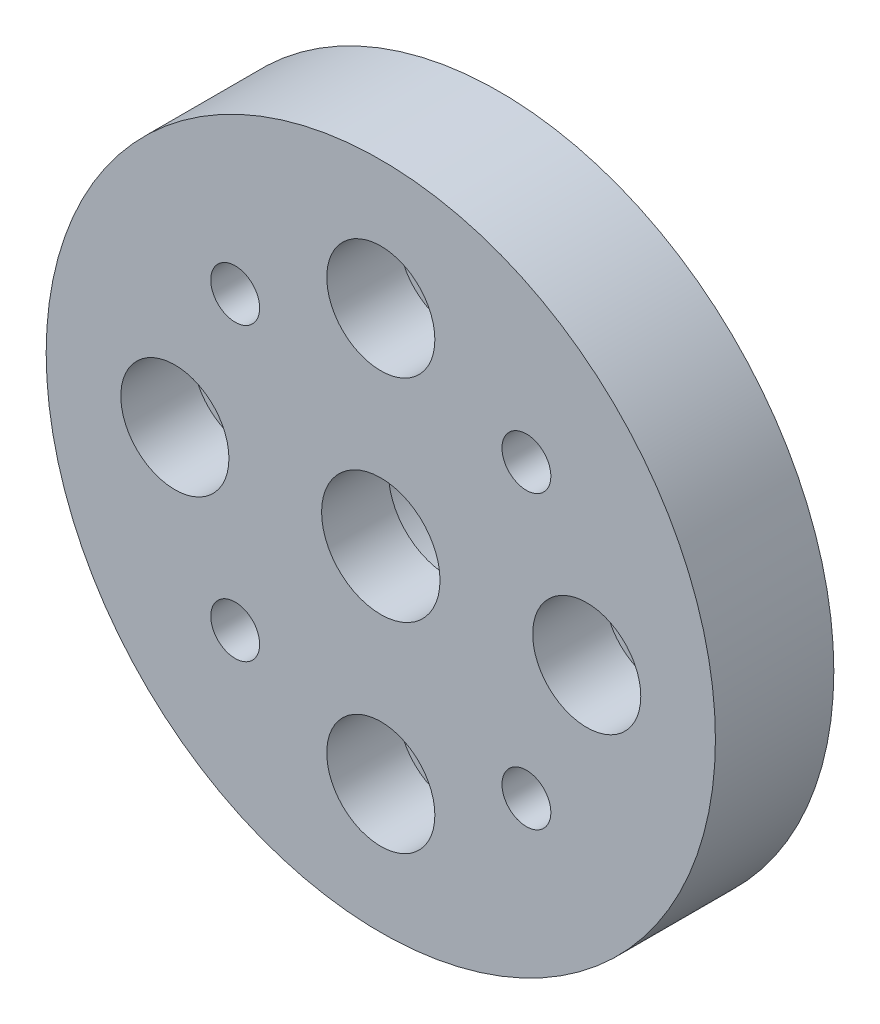
ISO-10303-21;
HEADER;
FILE_DESCRIPTION(('STEP AP214'),'2;1');
FILE_NAME('part.step','',(''),(''),'','','');
FILE_SCHEMA(('AUTOMOTIVE_DESIGN { 1 0 10303 214 1 1 1 1 }'));
ENDSEC;
DATA;
#1=APPLICATION_CONTEXT('core data for automotive mechanical design processes');
#2=APPLICATION_PROTOCOL_DEFINITION('international standard','automotive_design',2000,#1);
#3=PRODUCT_CONTEXT('',#1,'mechanical');
#4=PRODUCT('Part','Part','',(#3));
#5=PRODUCT_RELATED_PRODUCT_CATEGORY('part','',(#4));
#6=PRODUCT_DEFINITION_FORMATION('','',#4);
#7=PRODUCT_DEFINITION_CONTEXT('part definition',#1,'design');
#8=PRODUCT_DEFINITION('design','',#6,#7);
#9=PRODUCT_DEFINITION_SHAPE('','',#8);
#10=(LENGTH_UNIT() NAMED_UNIT(*) SI_UNIT(.MILLI.,.METRE.));
#11=(NAMED_UNIT(*) PLANE_ANGLE_UNIT() SI_UNIT($,.RADIAN.));
#12=(NAMED_UNIT(*) SI_UNIT($,.STERADIAN.) SOLID_ANGLE_UNIT());
#13=UNCERTAINTY_MEASURE_WITH_UNIT(LENGTH_MEASURE(1.E-05),#10,'distance_accuracy_value','');
#14=(GEOMETRIC_REPRESENTATION_CONTEXT(3) GLOBAL_UNCERTAINTY_ASSIGNED_CONTEXT((#13)) GLOBAL_UNIT_ASSIGNED_CONTEXT((#10,
#11,#12)) REPRESENTATION_CONTEXT('',''));
#15=CARTESIAN_POINT('',(0.,0.,0.));
#16=DIRECTION('',(0.,0.,1.));
#17=DIRECTION('',(1.,0.,0.));
#18=AXIS2_PLACEMENT_3D('',#15,#16,#17);
#19=CARTESIAN_POINT('',(0.,0.,4.6));
#20=DIRECTION('',(0.,0.,-1.));
#21=DIRECTION('',(-1.,0.,0.));
#22=AXIS2_PLACEMENT_3D('',#19,#20,#21);
#23=CYLINDRICAL_SURFACE('',#22,2.3);
#24=CARTESIAN_POINT('',(0.,0.,4.6));
#25=DIRECTION('',(0.,0.,1.));
#26=DIRECTION('',(1.,0.,0.));
#27=AXIS2_PLACEMENT_3D('',#24,#25,#26);
#28=CIRCLE('',#27,2.3);
#29=CARTESIAN_POINT('',(2.3,0.,4.6));
#30=VERTEX_POINT('',#29);
#31=EDGE_CURVE('E46',#30,#30,#28,.T.);
#32=ORIENTED_EDGE('',*,*,#31,.T.);
#33=EDGE_LOOP('',(#32));
#34=FACE_BOUND('',#33,.T.);
#35=CARTESIAN_POINT('',(0.,0.,2.));
#36=DIRECTION('',(0.,0.,-1.));
#37=DIRECTION('',(-1.,0.,0.));
#38=AXIS2_PLACEMENT_3D('',#35,#36,#37);
#39=CIRCLE('',#38,2.3);
#40=CARTESIAN_POINT('',(-2.3,0.,2.));
#41=VERTEX_POINT('',#40);
#42=EDGE_CURVE('E37',#41,#41,#39,.T.);
#43=ORIENTED_EDGE('',*,*,#42,.T.);
#44=EDGE_LOOP('',(#43));
#45=FACE_BOUND('',#44,.T.);
#46=ADVANCED_FACE('F33',(#34,#45),#23,.F.);
#47=CARTESIAN_POINT('',(8.00000000000027,2.75810479722345E-13,4.6));
#48=DIRECTION('',(0.,0.,-1.));
#49=DIRECTION('',(-1.,0.,0.));
#50=AXIS2_PLACEMENT_3D('',#47,#48,#49);
#51=CYLINDRICAL_SURFACE('',#50,1.10000000000009);
#52=CARTESIAN_POINT('',(8.00000000000027,2.75810479722345E-13,0.));
#53=DIRECTION('',(0.,0.,1.));
#54=DIRECTION('',(1.,0.,0.));
#55=AXIS2_PLACEMENT_3D('',#52,#53,#54);
#56=CIRCLE('',#55,1.10000000000009);
#57=CARTESIAN_POINT('',(9.10000000000036,2.75810479722345E-13,0.));
#58=VERTEX_POINT('',#57);
#59=EDGE_CURVE('E98',#58,#58,#56,.T.);
#60=ORIENTED_EDGE('',*,*,#59,.F.);
#61=EDGE_LOOP('',(#60));
#62=FACE_BOUND('',#61,.T.);
#63=CARTESIAN_POINT('',(8.00000000000027,2.75810479722345E-13,1.8));
#64=DIRECTION('',(0.,0.,1.));
#65=DIRECTION('',(1.,0.,0.));
#66=AXIS2_PLACEMENT_3D('',#63,#64,#65);
#67=CIRCLE('',#66,1.10000000000009);
#68=CARTESIAN_POINT('',(9.10000000000036,2.75810479722345E-13,1.8));
#69=VERTEX_POINT('',#68);
#70=EDGE_CURVE('E62',#69,#69,#67,.T.);
#71=ORIENTED_EDGE('',*,*,#70,.T.);
#72=EDGE_LOOP('',(#71));
#73=FACE_BOUND('',#72,.T.);
#74=ADVANCED_FACE('F146',(#62,#73),#51,.F.);
#75=CARTESIAN_POINT('',(5.5162095944469E-13,-8.,4.6));
#76=DIRECTION('',(0.,0.,-1.));
#77=DIRECTION('',(-1.,0.,0.));
#78=AXIS2_PLACEMENT_3D('',#75,#76,#77);
#79=CYLINDRICAL_SURFACE('',#78,1.10000000000014);
#80=CARTESIAN_POINT('',(5.5162095944469E-13,-8.,0.));
#81=DIRECTION('',(0.,0.,1.));
#82=DIRECTION('',(1.,0.,0.));
#83=AXIS2_PLACEMENT_3D('',#80,#81,#82);
#84=CIRCLE('',#83,1.10000000000014);
#85=CARTESIAN_POINT('',(1.10000000000069,-8.,0.));
#86=VERTEX_POINT('',#85);
#87=EDGE_CURVE('E95',#86,#86,#84,.T.);
#88=ORIENTED_EDGE('',*,*,#87,.F.);
#89=EDGE_LOOP('',(#88));
#90=FACE_BOUND('',#89,.T.);
#91=CARTESIAN_POINT('',(5.5162095944469E-13,-8.,1.8));
#92=DIRECTION('',(0.,0.,1.));
#93=DIRECTION('',(1.,0.,0.));
#94=AXIS2_PLACEMENT_3D('',#91,#92,#93);
#95=CIRCLE('',#94,1.10000000000014);
#96=CARTESIAN_POINT('',(1.10000000000069,-8.,1.8));
#97=VERTEX_POINT('',#96);
#98=EDGE_CURVE('E59',#97,#97,#95,.T.);
#99=ORIENTED_EDGE('',*,*,#98,.T.);
#100=EDGE_LOOP('',(#99));
#101=FACE_BOUND('',#100,.T.);
#102=ADVANCED_FACE('F151',(#90,#101),#79,.F.);
#103=CARTESIAN_POINT('',(-7.99999999999972,-2.76790197161663E-13,4.6));
#104=DIRECTION('',(0.,0.,-1.));
#105=DIRECTION('',(-1.,0.,0.));
#106=AXIS2_PLACEMENT_3D('',#103,#104,#105);
#107=CYLINDRICAL_SURFACE('',#106,1.10000000000022);
#108=CARTESIAN_POINT('',(-7.99999999999972,-2.76790197161663E-13,0.));
#109=DIRECTION('',(0.,0.,1.));
#110=DIRECTION('',(1.,0.,0.));
#111=AXIS2_PLACEMENT_3D('',#108,#109,#110);
#112=CIRCLE('',#111,1.10000000000022);
#113=CARTESIAN_POINT('',(-6.89999999999951,-2.76790197161663E-13,0.));
#114=VERTEX_POINT('',#113);
#115=EDGE_CURVE('E90',#114,#114,#112,.T.);
#116=ORIENTED_EDGE('',*,*,#115,.F.);
#117=EDGE_LOOP('',(#116));
#118=FACE_BOUND('',#117,.T.);
#119=CARTESIAN_POINT('',(-7.99999999999972,-2.76790197161663E-13,1.8));
#120=DIRECTION('',(0.,0.,1.));
#121=DIRECTION('',(1.,0.,0.));
#122=AXIS2_PLACEMENT_3D('',#119,#120,#121);
#123=CIRCLE('',#122,1.10000000000022);
#124=CARTESIAN_POINT('',(-6.89999999999951,-2.76790197161663E-13,1.8));
#125=VERTEX_POINT('',#124);
#126=EDGE_CURVE('E56',#125,#125,#123,.T.);
#127=ORIENTED_EDGE('',*,*,#126,.T.);
#128=EDGE_LOOP('',(#127));
#129=FACE_BOUND('',#128,.T.);
#130=ADVANCED_FACE('F157',(#118,#129),#107,.F.);
#131=CARTESIAN_POINT('',(0.,8.,4.6));
#132=DIRECTION('',(0.,0.,-1.));
#133=DIRECTION('',(-1.,0.,0.));
#134=AXIS2_PLACEMENT_3D('',#131,#132,#133);
#135=CYLINDRICAL_SURFACE('',#134,1.1);
#136=CARTESIAN_POINT('',(0.,8.,0.));
#137=DIRECTION('',(0.,0.,1.));
#138=DIRECTION('',(1.,0.,0.));
#139=AXIS2_PLACEMENT_3D('',#136,#137,#138);
#140=CIRCLE('',#139,1.1);
#141=CARTESIAN_POINT('',(1.1,8.,0.));
#142=VERTEX_POINT('',#141);
#143=EDGE_CURVE('E105',#142,#142,#140,.T.);
#144=ORIENTED_EDGE('',*,*,#143,.F.);
#145=EDGE_LOOP('',(#144));
#146=FACE_BOUND('',#145,.T.);
#147=CARTESIAN_POINT('',(0.,8.,1.8));
#148=DIRECTION('',(0.,0.,1.));
#149=DIRECTION('',(1.,0.,0.));
#150=AXIS2_PLACEMENT_3D('',#147,#148,#149);
#151=CIRCLE('',#150,1.1);
#152=CARTESIAN_POINT('',(1.1,8.,1.8));
#153=VERTEX_POINT('',#152);
#154=EDGE_CURVE('E51',#153,#153,#151,.T.);
#155=ORIENTED_EDGE('',*,*,#154,.T.);
#156=EDGE_LOOP('',(#155));
#157=FACE_BOUND('',#156,.T.);
#158=ADVANCED_FACE('F119',(#146,#157),#135,.F.);
#159=CARTESIAN_POINT('',(0.,0.,4.6));
#160=DIRECTION('',(0.,0.,1.));
#161=DIRECTION('',(1.,0.,0.));
#162=AXIS2_PLACEMENT_3D('',#159,#160,#161);
#163=PLANE('',#162);
#164=CARTESIAN_POINT('',(8.00000000000023,2.26393958003914E-13,4.6));
#165=DIRECTION('',(0.,0.,1.));
#166=DIRECTION('',(1.,0.,0.));
#167=AXIS2_PLACEMENT_3D('',#164,#165,#166);
#168=CIRCLE('',#167,2.10000000000018);
#169=CARTESIAN_POINT('',(10.1000000000004,2.26393958003914E-13,4.6));
#170=VERTEX_POINT('',#169);
#171=EDGE_CURVE('E229',#170,#170,#168,.T.);
#172=ORIENTED_EDGE('',*,*,#171,.F.);
#173=EDGE_LOOP('',(#172));
#174=FACE_BOUND('',#173,.T.);
#175=CARTESIAN_POINT('',(4.52787916007828E-13,-8.,4.6));
#176=DIRECTION('',(0.,0.,1.));
#177=DIRECTION('',(1.,0.,0.));
#178=AXIS2_PLACEMENT_3D('',#175,#176,#177);
#179=CIRCLE('',#178,2.10000000000049);
#180=CARTESIAN_POINT('',(2.10000000000094,-8.,4.6));
#181=VERTEX_POINT('',#180);
#182=EDGE_CURVE('E235',#181,#181,#179,.T.);
#183=ORIENTED_EDGE('',*,*,#182,.F.);
#184=EDGE_LOOP('',(#183));
#185=FACE_BOUND('',#184,.T.);
#186=CARTESIAN_POINT('',(-7.99999999999977,-2.27373675443232E-13,4.6));
#187=DIRECTION('',(0.,0.,1.));
#188=DIRECTION('',(1.,0.,0.));
#189=AXIS2_PLACEMENT_3D('',#186,#187,#188);
#190=CIRCLE('',#189,2.10000000000036);
#191=CARTESIAN_POINT('',(-5.89999999999941,-2.27373675443232E-13,4.6));
#192=VERTEX_POINT('',#191);
#193=EDGE_CURVE('E223',#192,#192,#190,.T.);
#194=ORIENTED_EDGE('',*,*,#193,.F.);
#195=EDGE_LOOP('',(#194));
#196=FACE_BOUND('',#195,.T.);
#197=CARTESIAN_POINT('',(0.,8.,4.6));
#198=DIRECTION('',(0.,0.,1.));
#199=DIRECTION('',(1.,0.,0.));
#200=AXIS2_PLACEMENT_3D('',#197,#198,#199);
#201=CIRCLE('',#200,2.1);
#202=CARTESIAN_POINT('',(2.1,8.,4.6));
#203=VERTEX_POINT('',#202);
#204=EDGE_CURVE('E64',#203,#203,#201,.T.);
#205=ORIENTED_EDGE('',*,*,#204,.F.);
#206=EDGE_LOOP('',(#205));
#207=FACE_BOUND('',#206,.T.);
#208=CARTESIAN_POINT('',(-5.65685424949207,-5.65685424949269,4.6));
#209=DIRECTION('',(0.,0.,1.));
#210=DIRECTION('',(1.,0.,0.));
#211=AXIS2_PLACEMENT_3D('',#208,#209,#210);
#212=CIRCLE('',#211,0.95000000000024);
#213=CARTESIAN_POINT('',(-4.70685424949183,-5.65685424949269,4.6));
#214=VERTEX_POINT('',#213);
#215=EDGE_CURVE('E81',#214,#214,#212,.T.);
#216=ORIENTED_EDGE('',*,*,#215,.F.);
#217=EDGE_LOOP('',(#216));
#218=FACE_BOUND('',#217,.T.);
#219=CARTESIAN_POINT('',(0.,0.,4.6));
#220=DIRECTION('',(0.,0.,1.));
#221=DIRECTION('',(1.,0.,0.));
#222=AXIS2_PLACEMENT_3D('',#219,#220,#221);
#223=CIRCLE('',#222,13.);
#224=CARTESIAN_POINT('',(13.,0.,4.6));
#225=VERTEX_POINT('',#224);
#226=EDGE_CURVE('E10',#225,#225,#223,.T.);
#227=ORIENTED_EDGE('',*,*,#226,.T.);
#228=EDGE_LOOP('',(#227));
#229=FACE_BOUND('',#228,.T.);
#230=ORIENTED_EDGE('',*,*,#31,.F.);
#231=EDGE_LOOP('',(#230));
#232=FACE_BOUND('',#231,.T.);
#233=CARTESIAN_POINT('',(5.65685424949239,5.65685424949237,4.6));
#234=DIRECTION('',(0.,0.,1.));
#235=DIRECTION('',(1.,0.,0.));
#236=AXIS2_PLACEMENT_3D('',#233,#234,#235);
#237=CIRCLE('',#236,0.950000000000002);
#238=CARTESIAN_POINT('',(6.60685424949239,5.65685424949237,4.6));
#239=VERTEX_POINT('',#238);
#240=EDGE_CURVE('E102',#239,#239,#237,.T.);
#241=ORIENTED_EDGE('',*,*,#240,.F.);
#242=EDGE_LOOP('',(#241));
#243=FACE_BOUND('',#242,.T.);
#244=CARTESIAN_POINT('',(5.65685424949269,-5.65685424949239,4.6));
#245=DIRECTION('',(0.,0.,1.));
#246=DIRECTION('',(1.,0.,0.));
#247=AXIS2_PLACEMENT_3D('',#244,#245,#246);
#248=CIRCLE('',#247,0.949999999999921);
#249=CARTESIAN_POINT('',(6.60685424949261,-5.65685424949239,4.6));
#250=VERTEX_POINT('',#249);
#251=EDGE_CURVE('E87',#250,#250,#248,.T.);
#252=ORIENTED_EDGE('',*,*,#251,.F.);
#253=EDGE_LOOP('',(#252));
#254=FACE_BOUND('',#253,.T.);
#255=CARTESIAN_POINT('',(-5.65685424949237,5.65685424949207,4.6));
#256=DIRECTION('',(0.,0.,1.));
#257=DIRECTION('',(1.,0.,0.));
#258=AXIS2_PLACEMENT_3D('',#255,#256,#257);
#259=CIRCLE('',#258,0.950000000000347);
#260=CARTESIAN_POINT('',(-4.70685424949202,5.65685424949207,4.6));
#261=VERTEX_POINT('',#260);
#262=EDGE_CURVE('E75',#261,#261,#259,.T.);
#263=ORIENTED_EDGE('',*,*,#262,.F.);
#264=EDGE_LOOP('',(#263));
#265=FACE_BOUND('',#264,.T.);
#266=ADVANCED_FACE('F115',(#174,#185,#196,#207,#218,#229,#232,#243,#254,#265),#163,.T.);
#267=CARTESIAN_POINT('',(0.,0.,0.));
#268=DIRECTION('',(0.,0.,1.));
#269=DIRECTION('',(1.,0.,0.));
#270=AXIS2_PLACEMENT_3D('',#267,#268,#269);
#271=PLANE('',#270);
#272=CARTESIAN_POINT('',(0.,0.,0.));
#273=DIRECTION('',(0.,0.,-1.));
#274=DIRECTION('',(-1.,0.,0.));
#275=AXIS2_PLACEMENT_3D('',#272,#273,#274);
#276=CIRCLE('',#275,4.2);
#277=CARTESIAN_POINT('',(-4.2,0.,0.));
#278=VERTEX_POINT('',#277);
#279=EDGE_CURVE('E221',#278,#278,#276,.T.);
#280=ORIENTED_EDGE('',*,*,#279,.F.);
#281=EDGE_LOOP('',(#280));
#282=FACE_BOUND('',#281,.T.);
#283=CARTESIAN_POINT('',(0.,0.,0.));
#284=DIRECTION('',(0.,0.,1.));
#285=DIRECTION('',(1.,0.,0.));
#286=AXIS2_PLACEMENT_3D('',#283,#284,#285);
#287=CIRCLE('',#286,13.);
#288=CARTESIAN_POINT('',(13.,0.,0.));
#289=VERTEX_POINT('',#288);
#290=EDGE_CURVE('E41',#289,#289,#287,.T.);
#291=ORIENTED_EDGE('',*,*,#290,.F.);
#292=EDGE_LOOP('',(#291));
#293=FACE_BOUND('',#292,.T.);
#294=ORIENTED_EDGE('',*,*,#143,.T.);
#295=EDGE_LOOP('',(#294));
#296=FACE_BOUND('',#295,.T.);
#297=CARTESIAN_POINT('',(5.65685424949239,5.65685424949237,0.));
#298=DIRECTION('',(0.,0.,1.));
#299=DIRECTION('',(1.,0.,0.));
#300=AXIS2_PLACEMENT_3D('',#297,#298,#299);
#301=CIRCLE('',#300,0.950000000000002);
#302=CARTESIAN_POINT('',(6.60685424949239,5.65685424949237,0.));
#303=VERTEX_POINT('',#302);
#304=EDGE_CURVE('E101',#303,#303,#301,.T.);
#305=ORIENTED_EDGE('',*,*,#304,.T.);
#306=EDGE_LOOP('',(#305));
#307=FACE_BOUND('',#306,.T.);
#308=ORIENTED_EDGE('',*,*,#59,.T.);
#309=EDGE_LOOP('',(#308));
#310=FACE_BOUND('',#309,.T.);
#311=ORIENTED_EDGE('',*,*,#87,.T.);
#312=EDGE_LOOP('',(#311));
#313=FACE_BOUND('',#312,.T.);
#314=ORIENTED_EDGE('',*,*,#115,.T.);
#315=EDGE_LOOP('',(#314));
#316=FACE_BOUND('',#315,.T.);
#317=CARTESIAN_POINT('',(5.65685424949269,-5.65685424949239,0.));
#318=DIRECTION('',(0.,0.,1.));
#319=DIRECTION('',(1.,0.,0.));
#320=AXIS2_PLACEMENT_3D('',#317,#318,#319);
#321=CIRCLE('',#320,0.949999999999921);
#322=CARTESIAN_POINT('',(6.60685424949261,-5.65685424949239,0.));
#323=VERTEX_POINT('',#322);
#324=EDGE_CURVE('E84',#323,#323,#321,.T.);
#325=ORIENTED_EDGE('',*,*,#324,.T.);
#326=EDGE_LOOP('',(#325));
#327=FACE_BOUND('',#326,.T.);
#328=CARTESIAN_POINT('',(-5.65685424949207,-5.65685424949269,0.));
#329=DIRECTION('',(0.,0.,1.));
#330=DIRECTION('',(1.,0.,0.));
#331=AXIS2_PLACEMENT_3D('',#328,#329,#330);
#332=CIRCLE('',#331,0.95000000000024);
#333=CARTESIAN_POINT('',(-4.70685424949183,-5.65685424949269,0.));
#334=VERTEX_POINT('',#333);
#335=EDGE_CURVE('E78',#334,#334,#332,.T.);
#336=ORIENTED_EDGE('',*,*,#335,.T.);
#337=EDGE_LOOP('',(#336));
#338=FACE_BOUND('',#337,.T.);
#339=CARTESIAN_POINT('',(-5.65685424949237,5.65685424949207,0.));
#340=DIRECTION('',(0.,0.,1.));
#341=DIRECTION('',(1.,0.,0.));
#342=AXIS2_PLACEMENT_3D('',#339,#340,#341);
#343=CIRCLE('',#342,0.950000000000347);
#344=CARTESIAN_POINT('',(-4.70685424949202,5.65685424949207,0.));
#345=VERTEX_POINT('',#344);
#346=EDGE_CURVE('E54',#345,#345,#343,.T.);
#347=ORIENTED_EDGE('',*,*,#346,.T.);
#348=EDGE_LOOP('',(#347));
#349=FACE_BOUND('',#348,.T.);
#350=ADVANCED_FACE('F118',(#282,#293,#296,#307,#310,#313,#316,#327,#338,#349),#271,.F.);
#351=CARTESIAN_POINT('',(0.,0.,4.6));
#352=DIRECTION('',(0.,0.,-1.));
#353=DIRECTION('',(-1.,0.,0.));
#354=AXIS2_PLACEMENT_3D('',#351,#352,#353);
#355=CYLINDRICAL_SURFACE('',#354,13.);
#356=ORIENTED_EDGE('',*,*,#226,.F.);
#357=EDGE_LOOP('',(#356));
#358=FACE_BOUND('',#357,.T.);
#359=ORIENTED_EDGE('',*,*,#290,.T.);
#360=EDGE_LOOP('',(#359));
#361=FACE_BOUND('',#360,.T.);
#362=ADVANCED_FACE('F35',(#358,#361),#355,.T.);
#363=CARTESIAN_POINT('',(5.65685424949239,5.65685424949237,4.6));
#364=DIRECTION('',(0.,0.,-1.));
#365=DIRECTION('',(-1.,0.,0.));
#366=AXIS2_PLACEMENT_3D('',#363,#364,#365);
#367=CYLINDRICAL_SURFACE('',#366,0.950000000000002);
#368=ORIENTED_EDGE('',*,*,#240,.T.);
#369=EDGE_LOOP('',(#368));
#370=FACE_BOUND('',#369,.T.);
#371=ORIENTED_EDGE('',*,*,#304,.F.);
#372=EDGE_LOOP('',(#371));
#373=FACE_BOUND('',#372,.T.);
#374=ADVANCED_FACE('F141',(#370,#373),#367,.F.);
#375=CARTESIAN_POINT('',(5.65685424949269,-5.65685424949239,4.6));
#376=DIRECTION('',(0.,0.,-1.));
#377=DIRECTION('',(-1.,0.,0.));
#378=AXIS2_PLACEMENT_3D('',#375,#376,#377);
#379=CYLINDRICAL_SURFACE('',#378,0.949999999999921);
#380=ORIENTED_EDGE('',*,*,#251,.T.);
#381=EDGE_LOOP('',(#380));
#382=FACE_BOUND('',#381,.T.);
#383=ORIENTED_EDGE('',*,*,#324,.F.);
#384=EDGE_LOOP('',(#383));
#385=FACE_BOUND('',#384,.T.);
#386=ADVANCED_FACE('F160',(#382,#385),#379,.F.);
#387=CARTESIAN_POINT('',(-5.65685424949207,-5.65685424949269,4.6));
#388=DIRECTION('',(0.,0.,-1.));
#389=DIRECTION('',(-1.,0.,0.));
#390=AXIS2_PLACEMENT_3D('',#387,#388,#389);
#391=CYLINDRICAL_SURFACE('',#390,0.95000000000024);
#392=ORIENTED_EDGE('',*,*,#215,.T.);
#393=EDGE_LOOP('',(#392));
#394=FACE_BOUND('',#393,.T.);
#395=ORIENTED_EDGE('',*,*,#335,.F.);
#396=EDGE_LOOP('',(#395));
#397=FACE_BOUND('',#396,.T.);
#398=ADVANCED_FACE('F132',(#394,#397),#391,.F.);
#399=CARTESIAN_POINT('',(-5.65685424949237,5.65685424949207,4.6));
#400=DIRECTION('',(0.,0.,-1.));
#401=DIRECTION('',(-1.,0.,0.));
#402=AXIS2_PLACEMENT_3D('',#399,#400,#401);
#403=CYLINDRICAL_SURFACE('',#402,0.950000000000347);
#404=ORIENTED_EDGE('',*,*,#262,.T.);
#405=EDGE_LOOP('',(#404));
#406=FACE_BOUND('',#405,.T.);
#407=ORIENTED_EDGE('',*,*,#346,.F.);
#408=EDGE_LOOP('',(#407));
#409=FACE_BOUND('',#408,.T.);
#410=ADVANCED_FACE('F128',(#406,#409),#403,.F.);
#411=CARTESIAN_POINT('',(0.,8.,1.8));
#412=DIRECTION('',(0.,0.,1.));
#413=DIRECTION('',(1.,0.,0.));
#414=AXIS2_PLACEMENT_3D('',#411,#412,#413);
#415=CYLINDRICAL_SURFACE('',#414,2.1);
#416=CARTESIAN_POINT('',(0.,8.,1.8));
#417=DIRECTION('',(0.,0.,1.));
#418=DIRECTION('',(1.,0.,0.));
#419=AXIS2_PLACEMENT_3D('',#416,#417,#418);
#420=CIRCLE('',#419,2.1);
#421=CARTESIAN_POINT('',(2.1,8.,1.8));
#422=VERTEX_POINT('',#421);
#423=EDGE_CURVE('E55',#422,#422,#420,.T.);
#424=ORIENTED_EDGE('',*,*,#423,.F.);
#425=EDGE_LOOP('',(#424));
#426=FACE_BOUND('',#425,.T.);
#427=ORIENTED_EDGE('',*,*,#204,.T.);
#428=EDGE_LOOP('',(#427));
#429=FACE_BOUND('',#428,.T.);
#430=ADVANCED_FACE('F131',(#426,#429),#415,.F.);
#431=CARTESIAN_POINT('',(0.,8.,1.8));
#432=DIRECTION('',(0.,0.,1.));
#433=DIRECTION('',(1.,0.,0.));
#434=AXIS2_PLACEMENT_3D('',#431,#432,#433);
#435=PLANE('',#434);
#436=ORIENTED_EDGE('',*,*,#154,.F.);
#437=EDGE_LOOP('',(#436));
#438=FACE_BOUND('',#437,.T.);
#439=ORIENTED_EDGE('',*,*,#423,.T.);
#440=EDGE_LOOP('',(#439));
#441=FACE_BOUND('',#440,.T.);
#442=ADVANCED_FACE('F177',(#438,#441),#435,.T.);
#443=CARTESIAN_POINT('',(-7.99999999999977,-2.27373675443232E-13,1.8));
#444=DIRECTION('',(0.,0.,1.));
#445=DIRECTION('',(1.,0.,0.));
#446=AXIS2_PLACEMENT_3D('',#443,#444,#445);
#447=CYLINDRICAL_SURFACE('',#446,2.10000000000036);
#448=CARTESIAN_POINT('',(-7.99999999999977,-2.27373675443232E-13,1.8));
#449=DIRECTION('',(0.,0.,1.));
#450=DIRECTION('',(1.,0.,0.));
#451=AXIS2_PLACEMENT_3D('',#448,#449,#450);
#452=CIRCLE('',#451,2.10000000000036);
#453=CARTESIAN_POINT('',(-5.89999999999941,-2.27373675443232E-13,1.8));
#454=VERTEX_POINT('',#453);
#455=EDGE_CURVE('E238',#454,#454,#452,.T.);
#456=ORIENTED_EDGE('',*,*,#455,.F.);
#457=EDGE_LOOP('',(#456));
#458=FACE_BOUND('',#457,.T.);
#459=ORIENTED_EDGE('',*,*,#193,.T.);
#460=EDGE_LOOP('',(#459));
#461=FACE_BOUND('',#460,.T.);
#462=ADVANCED_FACE('F181',(#458,#461),#447,.F.);
#463=CARTESIAN_POINT('',(-7.99999999999977,-2.27373675443232E-13,1.8));
#464=DIRECTION('',(0.,0.,1.));
#465=DIRECTION('',(1.,0.,0.));
#466=AXIS2_PLACEMENT_3D('',#463,#464,#465);
#467=PLANE('',#466);
#468=ORIENTED_EDGE('',*,*,#126,.F.);
#469=EDGE_LOOP('',(#468));
#470=FACE_BOUND('',#469,.T.);
#471=ORIENTED_EDGE('',*,*,#455,.T.);
#472=EDGE_LOOP('',(#471));
#473=FACE_BOUND('',#472,.T.);
#474=ADVANCED_FACE('F185',(#470,#473),#467,.T.);
#475=CARTESIAN_POINT('',(4.52787916007828E-13,-8.,1.8));
#476=DIRECTION('',(0.,0.,1.));
#477=DIRECTION('',(1.,0.,0.));
#478=AXIS2_PLACEMENT_3D('',#475,#476,#477);
#479=CYLINDRICAL_SURFACE('',#478,2.10000000000049);
#480=CARTESIAN_POINT('',(4.52787916007828E-13,-8.,1.8));
#481=DIRECTION('',(0.,0.,1.));
#482=DIRECTION('',(1.,0.,0.));
#483=AXIS2_PLACEMENT_3D('',#480,#481,#482);
#484=CIRCLE('',#483,2.10000000000049);
#485=CARTESIAN_POINT('',(2.10000000000094,-8.,1.8));
#486=VERTEX_POINT('',#485);
#487=EDGE_CURVE('E232',#486,#486,#484,.T.);
#488=ORIENTED_EDGE('',*,*,#487,.F.);
#489=EDGE_LOOP('',(#488));
#490=FACE_BOUND('',#489,.T.);
#491=ORIENTED_EDGE('',*,*,#182,.T.);
#492=EDGE_LOOP('',(#491));
#493=FACE_BOUND('',#492,.T.);
#494=ADVANCED_FACE('F189',(#490,#493),#479,.F.);
#495=CARTESIAN_POINT('',(4.52787916007828E-13,-8.,1.8));
#496=DIRECTION('',(0.,0.,1.));
#497=DIRECTION('',(1.,0.,0.));
#498=AXIS2_PLACEMENT_3D('',#495,#496,#497);
#499=PLANE('',#498);
#500=ORIENTED_EDGE('',*,*,#98,.F.);
#501=EDGE_LOOP('',(#500));
#502=FACE_BOUND('',#501,.T.);
#503=ORIENTED_EDGE('',*,*,#487,.T.);
#504=EDGE_LOOP('',(#503));
#505=FACE_BOUND('',#504,.T.);
#506=ADVANCED_FACE('F193',(#502,#505),#499,.T.);
#507=CARTESIAN_POINT('',(8.00000000000023,2.26393958003914E-13,1.8));
#508=DIRECTION('',(0.,0.,1.));
#509=DIRECTION('',(1.,0.,0.));
#510=AXIS2_PLACEMENT_3D('',#507,#508,#509);
#511=CYLINDRICAL_SURFACE('',#510,2.10000000000018);
#512=CARTESIAN_POINT('',(8.00000000000023,2.26393958003914E-13,1.8));
#513=DIRECTION('',(0.,0.,1.));
#514=DIRECTION('',(1.,0.,0.));
#515=AXIS2_PLACEMENT_3D('',#512,#513,#514);
#516=CIRCLE('',#515,2.10000000000018);
#517=CARTESIAN_POINT('',(10.1000000000004,2.26393958003914E-13,1.8));
#518=VERTEX_POINT('',#517);
#519=EDGE_CURVE('E60',#518,#518,#516,.T.);
#520=ORIENTED_EDGE('',*,*,#519,.F.);
#521=EDGE_LOOP('',(#520));
#522=FACE_BOUND('',#521,.T.);
#523=ORIENTED_EDGE('',*,*,#171,.T.);
#524=EDGE_LOOP('',(#523));
#525=FACE_BOUND('',#524,.T.);
#526=ADVANCED_FACE('F197',(#522,#525),#511,.F.);
#527=CARTESIAN_POINT('',(8.00000000000023,2.26393958003914E-13,1.8));
#528=DIRECTION('',(0.,0.,1.));
#529=DIRECTION('',(1.,0.,0.));
#530=AXIS2_PLACEMENT_3D('',#527,#528,#529);
#531=PLANE('',#530);
#532=ORIENTED_EDGE('',*,*,#70,.F.);
#533=EDGE_LOOP('',(#532));
#534=FACE_BOUND('',#533,.T.);
#535=ORIENTED_EDGE('',*,*,#519,.T.);
#536=EDGE_LOOP('',(#535));
#537=FACE_BOUND('',#536,.T.);
#538=ADVANCED_FACE('F201',(#534,#537),#531,.T.);
#539=CARTESIAN_POINT('',(0.,0.,2.));
#540=DIRECTION('',(0.,0.,-1.));
#541=DIRECTION('',(-1.,0.,0.));
#542=AXIS2_PLACEMENT_3D('',#539,#540,#541);
#543=CYLINDRICAL_SURFACE('',#542,4.2);
#544=CARTESIAN_POINT('',(0.,0.,2.));
#545=DIRECTION('',(0.,0.,-1.));
#546=DIRECTION('',(-1.,0.,0.));
#547=AXIS2_PLACEMENT_3D('',#544,#545,#546);
#548=CIRCLE('',#547,4.2);
#549=CARTESIAN_POINT('',(-4.2,0.,2.));
#550=VERTEX_POINT('',#549);
#551=EDGE_CURVE('E220',#550,#550,#548,.T.);
#552=ORIENTED_EDGE('',*,*,#551,.F.);
#553=EDGE_LOOP('',(#552));
#554=FACE_BOUND('',#553,.T.);
#555=ORIENTED_EDGE('',*,*,#279,.T.);
#556=EDGE_LOOP('',(#555));
#557=FACE_BOUND('',#556,.T.);
#558=ADVANCED_FACE('F205',(#554,#557),#543,.F.);
#559=CARTESIAN_POINT('',(0.,0.,2.));
#560=DIRECTION('',(0.,0.,-1.));
#561=DIRECTION('',(-1.,0.,0.));
#562=AXIS2_PLACEMENT_3D('',#559,#560,#561);
#563=PLANE('',#562);
#564=ORIENTED_EDGE('',*,*,#42,.F.);
#565=EDGE_LOOP('',(#564));
#566=FACE_BOUND('',#565,.T.);
#567=ORIENTED_EDGE('',*,*,#551,.T.);
#568=EDGE_LOOP('',(#567));
#569=FACE_BOUND('',#568,.T.);
#570=ADVANCED_FACE('F209',(#566,#569),#563,.T.);
#571=CLOSED_SHELL('',(#46,#74,#102,#130,#158,#266,#350,#362,#374,#386,#398,#410,#430,#442,#462,
#474,#494,#506,#526,#538,#558,#570));
#572=MANIFOLD_SOLID_BREP('B2',#571);
#573=ADVANCED_BREP_SHAPE_REPRESENTATION('',(#18,#572),#14);
#574=SHAPE_DEFINITION_REPRESENTATION(#9,#573);
ENDSEC;
END-ISO-10303-21;
